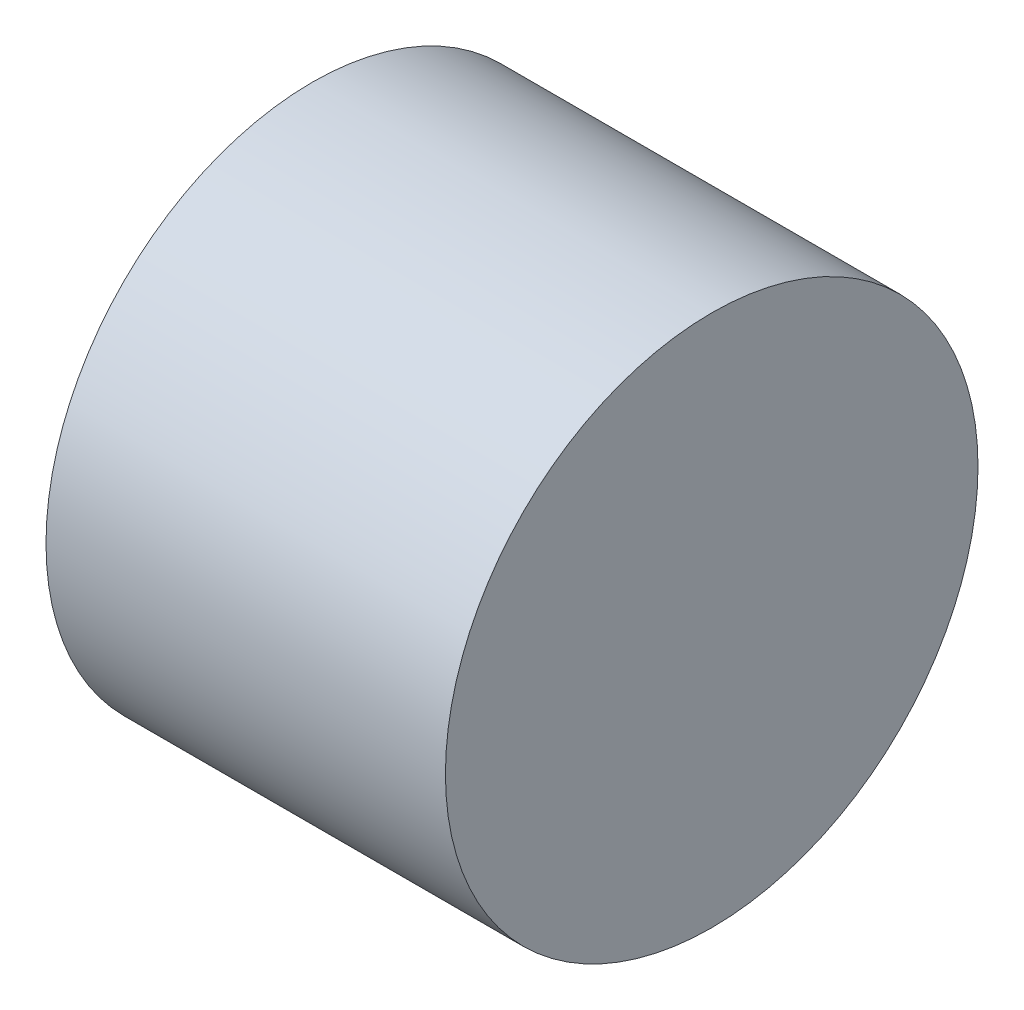
ISO-10303-21;
HEADER;
FILE_DESCRIPTION(('STEP AP214'),'2;1');
FILE_NAME('part.step','',(''),(''),'','','');
FILE_SCHEMA(('AUTOMOTIVE_DESIGN { 1 0 10303 214 1 1 1 1 }'));
ENDSEC;
DATA;
#1=APPLICATION_CONTEXT('core data for automotive mechanical design processes');
#2=APPLICATION_PROTOCOL_DEFINITION('international standard','automotive_design',2000,#1);
#3=PRODUCT_CONTEXT('',#1,'mechanical');
#4=PRODUCT('Part','Part','',(#3));
#5=PRODUCT_RELATED_PRODUCT_CATEGORY('part','',(#4));
#6=PRODUCT_DEFINITION_FORMATION('','',#4);
#7=PRODUCT_DEFINITION_CONTEXT('part definition',#1,'design');
#8=PRODUCT_DEFINITION('design','',#6,#7);
#9=PRODUCT_DEFINITION_SHAPE('','',#8);
#10=(LENGTH_UNIT() NAMED_UNIT(*) SI_UNIT(.MILLI.,.METRE.));
#11=(NAMED_UNIT(*) PLANE_ANGLE_UNIT() SI_UNIT($,.RADIAN.));
#12=(NAMED_UNIT(*) SI_UNIT($,.STERADIAN.) SOLID_ANGLE_UNIT());
#13=UNCERTAINTY_MEASURE_WITH_UNIT(LENGTH_MEASURE(1.E-05),#10,'distance_accuracy_value','');
#14=(GEOMETRIC_REPRESENTATION_CONTEXT(3) GLOBAL_UNCERTAINTY_ASSIGNED_CONTEXT((#13)) GLOBAL_UNIT_ASSIGNED_CONTEXT((#10,
#11,#12)) REPRESENTATION_CONTEXT('',''));
#15=CARTESIAN_POINT('',(0.,0.,0.));
#16=DIRECTION('',(0.,0.,1.));
#17=DIRECTION('',(1.,0.,0.));
#18=AXIS2_PLACEMENT_3D('',#15,#16,#17);
#19=CARTESIAN_POINT('',(0.380999999999965,0.,0.));
#20=DIRECTION('',(1.00000000000001,0.,0.));
#21=DIRECTION('',(0.,0.,-1.00000000000001));
#22=AXIS2_PLACEMENT_3D('',#19,#20,#21);
#23=PLANE('',#22);
#24=CARTESIAN_POINT('',(0.380999999999965,0.,0.));
#25=DIRECTION('',(-1.00000000000001,0.,0.));
#26=DIRECTION('',(0.,0.,1.00000000000001));
#27=AXIS2_PLACEMENT_3D('',#24,#25,#26);
#28=CIRCLE('',#27,0.254);
#29=CARTESIAN_POINT('',(0.380999999999965,0.,0.254000000000003));
#30=VERTEX_POINT('',#29);
#31=EDGE_CURVE('E17',#30,#30,#28,.T.);
#32=ORIENTED_EDGE('',*,*,#31,.F.);
#33=EDGE_LOOP('',(#32));
#34=FACE_BOUND('',#33,.T.);
#35=ADVANCED_FACE('F14',(#34),#23,.T.);
#36=CARTESIAN_POINT('',(0.,0.,0.));
#37=DIRECTION('',(1.00000000000001,0.,0.));
#38=DIRECTION('',(0.,0.,-1.00000000000001));
#39=AXIS2_PLACEMENT_3D('',#36,#37,#38);
#40=PLANE('',#39);
#41=CARTESIAN_POINT('',(0.,0.,0.));
#42=DIRECTION('',(-1.00000000000001,0.,0.));
#43=DIRECTION('',(0.,0.,1.00000000000001));
#44=AXIS2_PLACEMENT_3D('',#41,#42,#43);
#45=CIRCLE('',#44,0.254);
#46=CARTESIAN_POINT('',(0.,0.,0.254000000000003));
#47=VERTEX_POINT('',#46);
#48=EDGE_CURVE('E10',#47,#47,#45,.F.);
#49=ORIENTED_EDGE('',*,*,#48,.F.);
#50=EDGE_LOOP('',(#49));
#51=FACE_BOUND('',#50,.T.);
#52=ADVANCED_FACE('F29',(#51),#40,.F.);
#53=CARTESIAN_POINT('',(0.380999999999965,0.,0.));
#54=DIRECTION('',(-1.00000000000001,0.,0.));
#55=DIRECTION('',(0.,0.,1.00000000000001));
#56=AXIS2_PLACEMENT_3D('',#53,#54,#55);
#57=CYLINDRICAL_SURFACE('',#56,0.254);
#58=ORIENTED_EDGE('',*,*,#48,.T.);
#59=EDGE_LOOP('',(#58));
#60=FACE_BOUND('',#59,.T.);
#61=ORIENTED_EDGE('',*,*,#31,.T.);
#62=EDGE_LOOP('',(#61));
#63=FACE_BOUND('',#62,.T.);
#64=ADVANCED_FACE('F26',(#60,#63),#57,.T.);
#65=CLOSED_SHELL('',(#35,#52,#64));
#66=MANIFOLD_SOLID_BREP('B1',#65);
#67=ADVANCED_BREP_SHAPE_REPRESENTATION('',(#18,#66),#14);
#68=SHAPE_DEFINITION_REPRESENTATION(#9,#67);
ENDSEC;
END-ISO-10303-21;
